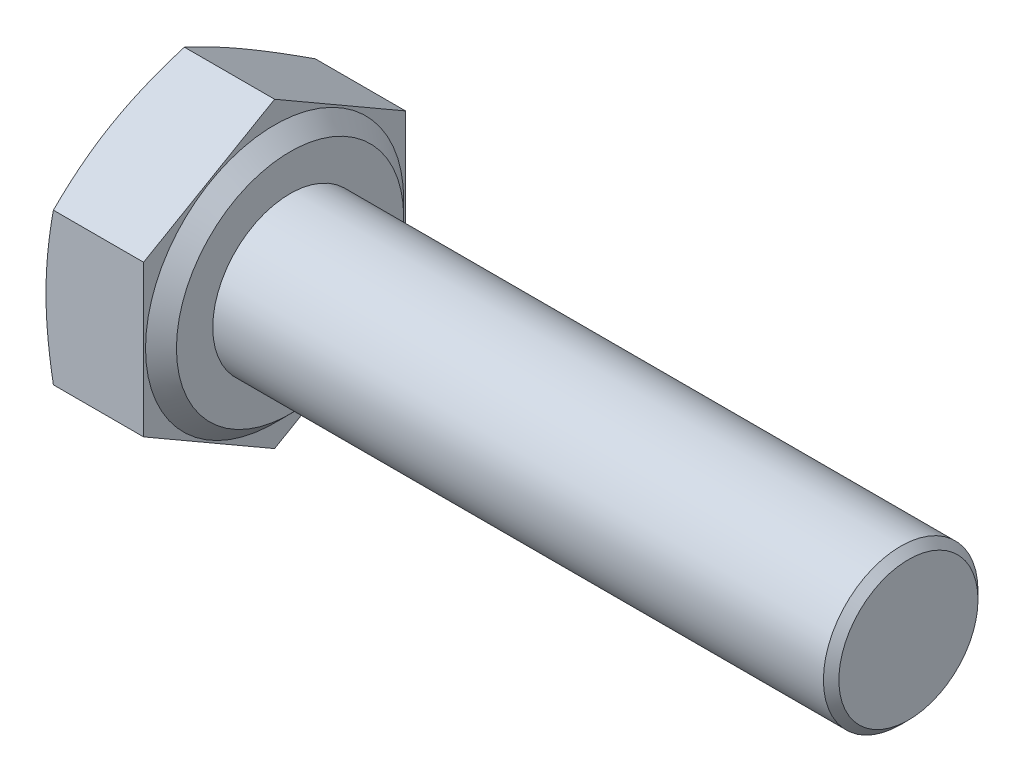
ISO-10303-21;
HEADER;
FILE_DESCRIPTION(('STEP AP214'),'2;1');
FILE_NAME('part.step','',(''),(''),'','','');
FILE_SCHEMA(('AUTOMOTIVE_DESIGN { 1 0 10303 214 1 1 1 1 }'));
ENDSEC;
DATA;
#1=APPLICATION_CONTEXT('core data for automotive mechanical design processes');
#2=APPLICATION_PROTOCOL_DEFINITION('international standard','automotive_design',2000,#1);
#3=PRODUCT_CONTEXT('',#1,'mechanical');
#4=PRODUCT('Part','Part','',(#3));
#5=PRODUCT_RELATED_PRODUCT_CATEGORY('part','',(#4));
#6=PRODUCT_DEFINITION_FORMATION('','',#4);
#7=PRODUCT_DEFINITION_CONTEXT('part definition',#1,'design');
#8=PRODUCT_DEFINITION('design','',#6,#7);
#9=PRODUCT_DEFINITION_SHAPE('','',#8);
#10=(LENGTH_UNIT() NAMED_UNIT(*) SI_UNIT(.MILLI.,.METRE.));
#11=(NAMED_UNIT(*) PLANE_ANGLE_UNIT() SI_UNIT($,.RADIAN.));
#12=(NAMED_UNIT(*) SI_UNIT($,.STERADIAN.) SOLID_ANGLE_UNIT());
#13=UNCERTAINTY_MEASURE_WITH_UNIT(LENGTH_MEASURE(1.E-05),#10,'distance_accuracy_value','');
#14=(GEOMETRIC_REPRESENTATION_CONTEXT(3) GLOBAL_UNCERTAINTY_ASSIGNED_CONTEXT((#13)) GLOBAL_UNIT_ASSIGNED_CONTEXT((#10,
#11,#12)) REPRESENTATION_CONTEXT('',''));
#15=CARTESIAN_POINT('',(0.,0.,0.));
#16=DIRECTION('',(0.,0.,1.));
#17=DIRECTION('',(1.,0.,0.));
#18=AXIS2_PLACEMENT_3D('',#15,#16,#17);
#19=CARTESIAN_POINT('',(2.925,-5.87165223765849,3.39));
#20=DIRECTION('',(-1.,0.,0.));
#21=DIRECTION('',(0.,0.,1.));
#22=AXIS2_PLACEMENT_3D('',#19,#20,#21);
#23=PLANE('',#22);
#24=CARTESIAN_POINT('',(2.925,0.,0.));
#25=DIRECTION('',(-1.,0.,0.));
#26=DIRECTION('',(0.,0.,1.));
#27=AXIS2_PLACEMENT_3D('',#24,#25,#26);
#28=CIRCLE('',#27,2.94);
#29=CARTESIAN_POINT('',(2.925,0.,2.94));
#30=VERTEX_POINT('',#29);
#31=EDGE_CURVE('E381',#30,#30,#28,.T.);
#32=ORIENTED_EDGE('',*,*,#31,.F.);
#33=EDGE_LOOP('',(#32));
#34=FACE_BOUND('',#33,.T.);
#35=CARTESIAN_POINT('',(2.925,0.,0.));
#36=DIRECTION('',(-1.,0.,0.));
#37=DIRECTION('',(0.,0.,1.));
#38=AXIS2_PLACEMENT_3D('',#35,#36,#37);
#39=CIRCLE('',#38,2.);
#40=CARTESIAN_POINT('',(2.925,0.,2.));
#41=VERTEX_POINT('',#40);
#42=EDGE_CURVE('E153',#41,#41,#39,.F.);
#43=ORIENTED_EDGE('',*,*,#42,.F.);
#44=EDGE_LOOP('',(#43));
#45=FACE_BOUND('',#44,.T.);
#46=ADVANCED_FACE('F37',(#34,#45),#23,.F.);
#47=CARTESIAN_POINT('',(2.925,-3.91443482510566,0.));
#48=DIRECTION('',(0.,0.866025403784439,0.5));
#49=DIRECTION('',(0.,-0.5,0.866025403784439));
#50=AXIS2_PLACEMENT_3D('',#47,#48,#49);
#51=PLANE('',#50);
#52=CARTESIAN_POINT('',(0.190920695673182,-1.957101942499,-3.3902));
#53=CARTESIAN_POINT('',(0.161404170530895,-2.03816412054654,-3.24979618904947));
#54=CARTESIAN_POINT('',(0.134553686064012,-2.11949362286094,-3.10892935888662));
#55=CARTESIAN_POINT('',(0.087314294592719,-2.28268148917413,-2.82627968325343));
#56=CARTESIAN_POINT('',(0.0669304448507114,-2.36454021625955,-2.68449620889857));
#57=CARTESIAN_POINT('',(0.0339601092717298,-2.52787800101785,-2.40158686690143));
#58=CARTESIAN_POINT('',(0.0213017035221394,-2.6093533276861,-2.26046746154876));
#59=CARTESIAN_POINT('',(0.00432321252371604,-2.77249453116584,-1.97789860831391));
#60=CARTESIAN_POINT('',(0.,-2.85416032499754,-1.83644930415696));
#61=CARTESIAN_POINT('',(0.,-3.01749191266095,-1.55355069584304));
#62=CARTESIAN_POINT('',(0.00432321252371604,-3.09915770649266,-1.41210139168608));
#63=CARTESIAN_POINT('',(0.0213017035221394,-3.2622989099724,-1.12953253845124));
#64=CARTESIAN_POINT('',(0.0339601092717299,-3.34377423664064,-0.988413133098569));
#65=CARTESIAN_POINT('',(0.0669304448507115,-3.50711202139895,-0.70550379110143));
#66=CARTESIAN_POINT('',(0.087314294592719,-3.58897074848437,-0.563720316746573));
#67=CARTESIAN_POINT('',(0.134553686064013,-3.75215861479756,-0.281070641113374));
#68=CARTESIAN_POINT('',(0.161404170530895,-3.83348811711196,-0.140203810950532));
#69=CARTESIAN_POINT('',(0.190920695673182,-3.9145502951595,0.000200000000001568));
#70=B_SPLINE_CURVE_WITH_KNOTS('',3,(#52,#53,#54,#55,#56,#57,#58,#59,#60,#61,#62,#63,#64,#65,#66,
#67,#68,#69),.UNSPECIFIED.,.F.,.F.,(4,2,2,2,2,2,2,2,4),(0.,0.494419076649432,0.98922386830733,
1.47934907283627,1.96929035184584,2.45923163085541,2.94935683538435,3.44416162704225,
3.93858070369168),.UNSPECIFIED.);
#71=CARTESIAN_POINT('',(0.19087866615106,-1.95721741255283,-3.39));
#72=VERTEX_POINT('',#71);
#73=CARTESIAN_POINT('',(0.,-2.93582611882925,-1.695));
#74=VERTEX_POINT('',#73);
#75=EDGE_CURVE('E116',#72,#74,#70,.T.);
#76=ORIENTED_EDGE('',*,*,#75,.F.);
#77=DIRECTION('',(-1.,0.,0.));
#78=VECTOR('',#77,1.);
#79=CARTESIAN_POINT('',(2.925,-1.95721741255283,-3.39));
#80=LINE('',#79,#78);
#81=CARTESIAN_POINT('',(2.525,-1.95721741255283,-3.39));
#82=VERTEX_POINT('',#81);
#83=EDGE_CURVE('E145',#82,#72,#80,.T.);
#84=ORIENTED_EDGE('',*,*,#83,.F.);
#85=DIRECTION('',(0.,0.5,-0.866025403784439));
#86=VECTOR('',#85,1.);
#87=CARTESIAN_POINT('',(2.525,-3.91443482510566,0.));
#88=LINE('',#87,#86);
#89=CARTESIAN_POINT('',(2.525,-3.91443482510566,0.));
#90=VERTEX_POINT('',#89);
#91=EDGE_CURVE('E396',#90,#82,#88,.T.);
#92=ORIENTED_EDGE('',*,*,#91,.F.);
#93=DIRECTION('',(-1.,0.,0.));
#94=VECTOR('',#93,1.);
#95=CARTESIAN_POINT('',(2.925,-3.91443482510566,0.));
#96=LINE('',#95,#94);
#97=CARTESIAN_POINT('',(0.19087866615106,-3.91443482510566,0.));
#98=VERTEX_POINT('',#97);
#99=EDGE_CURVE('E139',#90,#98,#96,.T.);
#100=ORIENTED_EDGE('',*,*,#99,.T.);
#101=EDGE_CURVE('E219',#74,#98,#70,.T.);
#102=ORIENTED_EDGE('',*,*,#101,.F.);
#103=EDGE_LOOP('',(#76,#84,#92,#100,#102));
#104=FACE_BOUND('',#103,.T.);
#105=ADVANCED_FACE('F169',(#104),#51,.F.);
#106=CARTESIAN_POINT('',(2.925,-1.95721741255283,-3.39));
#107=DIRECTION('',(0.,0.,1.));
#108=DIRECTION('',(0.,-1.,0.));
#109=AXIS2_PLACEMENT_3D('',#106,#107,#108);
#110=PLANE('',#109);
#111=CARTESIAN_POINT('',(1.01997989354759,-5.18202350349092,-3.39));
#112=CARTESIAN_POINT('',(0.973277002242208,-5.02864764339971,-3.39));
#113=CARTESIAN_POINT('',(0.92711907287694,-4.87510275748851,-3.39));
#114=CARTESIAN_POINT('',(0.836194610175299,-4.56758888202956,-3.39));
#115=CARTESIAN_POINT('',(0.791428186940742,-4.41361985996635,-3.39));
#116=CARTESIAN_POINT('',(0.703513740136747,-4.1049081257591,-3.39));
#117=CARTESIAN_POINT('',(0.660368891930327,-3.9501645060724,-3.39));
#118=CARTESIAN_POINT('',(0.576202703755944,-3.64010163790345,-3.39));
#119=CARTESIAN_POINT('',(0.535181325660586,-3.48478239981026,-3.39));
#120=CARTESIAN_POINT('',(0.456277437117914,-3.17538416295869,-3.39));
#121=CARTESIAN_POINT('',(0.41836246095362,-3.02131348495735,-3.39));
#122=CARTESIAN_POINT('',(0.345760478621676,-2.71240531015016,-3.39));
#123=CARTESIAN_POINT('',(0.31107352977889,-2.55756779977793,-3.39));
#124=CARTESIAN_POINT('',(0.245736727919533,-2.24709331546656,-3.39));
#125=CARTESIAN_POINT('',(0.215085449738309,-2.09145664402713,-3.39));
#126=CARTESIAN_POINT('',(0.158752150984607,-1.7792761387277,-3.39));
#127=CARTESIAN_POINT('',(0.133070078323606,-1.62273231439442,-3.39));
#128=CARTESIAN_POINT('',(0.090261553181783,-1.32636320569982,-3.39));
#129=CARTESIAN_POINT('',(0.0724987882413199,-1.18663069691262,-3.39));
#130=CARTESIAN_POINT('',(0.0424324881028125,-0.90658866966141,-3.39));
#131=CARTESIAN_POINT('',(0.0301282534946796,-0.766279227447352,-3.39));
#132=CARTESIAN_POINT('',(0.0115684693108668,-0.485347204994704,-3.39));
#133=CARTESIAN_POINT('',(0.00530893988923471,-0.344724891973988,-3.39));
#134=CARTESIAN_POINT('',(-0.000843430608762965,-0.0633395865578563,-3.39));
#135=CARTESIAN_POINT('',(-0.000736316645790475,0.0774234048370814,-3.39));
#136=CARTESIAN_POINT('',(0.00585535977490626,0.359511810579511,-3.39));
#137=CARTESIAN_POINT('',(0.0123722627973921,0.500836456802893,-3.39));
#138=CARTESIAN_POINT('',(0.0314839573460986,0.783070507641831,-3.39));
#139=CARTESIAN_POINT('',(0.0440788948926872,0.923979902199434,-3.39));
#140=CARTESIAN_POINT('',(0.0747561661274569,1.20531451424879,-3.39));
#141=CARTESIAN_POINT('',(0.0928432130380238,1.34573921068275,-3.39));
#142=CARTESIAN_POINT('',(0.133775937021107,1.62588419860853,-3.39));
#143=CARTESIAN_POINT('',(0.156621639598428,1.76560448632084,-3.39));
#144=CARTESIAN_POINT('',(0.233780310562576,2.19842531997455,-3.39));
#145=CARTESIAN_POINT('',(0.2949559556305,2.49029899907325,-3.39));
#146=CARTESIAN_POINT('',(0.429080881996319,3.07133579793219,-3.39));
#147=CARTESIAN_POINT('',(0.50203440390027,3.36049790156764,-3.39));
#148=CARTESIAN_POINT('',(0.655790287789299,3.93710836070672,-3.39));
#149=CARTESIAN_POINT('',(0.736602683097902,4.22455401473238,-3.39));
#150=CARTESIAN_POINT('',(0.903426263150169,4.79786794795153,-3.39));
#151=CARTESIAN_POINT('',(0.989436623009952,5.08373646960922,-3.39));
#152=CARTESIAN_POINT('',(1.16408508397131,5.65121216000978,-3.39));
#153=CARTESIAN_POINT('',(1.25268370134974,5.93283153633289,-3.39));
#154=CARTESIAN_POINT('',(1.43239756302466,6.49527837196232,-3.39));
#155=CARTESIAN_POINT('',(1.52351292806606,6.77610579255849,-3.39));
#156=CARTESIAN_POINT('',(1.70722886302289,7.3360928788821,-3.39));
#157=CARTESIAN_POINT('',(1.79982248576516,7.61525482955922,-3.39));
#158=CARTESIAN_POINT('',(1.98639802369662,8.17308924398157,-3.39));
#159=CARTESIAN_POINT('',(2.08037982391118,8.45176174614948,-3.39));
#160=CARTESIAN_POINT('',(2.17484728105454,8.73026714408881,-3.39));
#161=B_SPLINE_CURVE_WITH_KNOTS('',3,(#111,#112,#113,#114,#115,#116,#117,#118,#119,#120,#121,
#122,#123,#124,#125,#126,#127,#128,#129,#130,#131,#132,#133,#134,#135,#136,#137,#138,#139,#140,
#141,#142,#143,#144,#145,#146,#147,#148,#149,#150,#151,#152,#153,#154,#155,#156,#157,#158,#159,
#160),.UNSPECIFIED.,.F.,.F.,(4,2,2,2,2,2,2,2,2,2,2,2,2,2,2,2,2,2,2,2,2,2,2,2,4),(0.,
0.480989717785644,0.962017397120821,1.44394255408912,1.92585905497698,2.40183354492129,
2.87781648583752,3.35363088376765,3.82944029381557,4.25191845933479,4.67434247641531,
5.09648817867019,5.51863089977051,5.94291452361967,6.36720834108242,6.79186731337204,
7.21652856175055,8.11074113208825,9.00527638324549,9.90096905563469,10.7965199586567,
11.6821858830082,12.5678943726271,13.4502421784021,14.3325173097535),.UNSPECIFIED.);
#162=CARTESIAN_POINT('',(0.19087866615106,1.95721741255283,-3.39));
#163=VERTEX_POINT('',#162);
#164=CARTESIAN_POINT('',(0.,0.,-3.39));
#165=VERTEX_POINT('',#164);
#166=EDGE_CURVE('E231',#163,#165,#161,.F.);
#167=ORIENTED_EDGE('',*,*,#166,.F.);
#168=DIRECTION('',(-1.,0.,0.));
#169=VECTOR('',#168,1.);
#170=CARTESIAN_POINT('',(2.925,1.95721741255283,-3.39));
#171=LINE('',#170,#169);
#172=CARTESIAN_POINT('',(2.525,1.95721741255283,-3.39));
#173=VERTEX_POINT('',#172);
#174=EDGE_CURVE('E136',#173,#163,#171,.T.);
#175=ORIENTED_EDGE('',*,*,#174,.F.);
#176=DIRECTION('',(0.,1.,0.));
#177=VECTOR('',#176,1.);
#178=CARTESIAN_POINT('',(2.525,-1.95721741255283,-3.39));
#179=LINE('',#178,#177);
#180=EDGE_CURVE('E394',#82,#173,#179,.T.);
#181=ORIENTED_EDGE('',*,*,#180,.F.);
#182=ORIENTED_EDGE('',*,*,#83,.T.);
#183=EDGE_CURVE('E127',#165,#72,#161,.F.);
#184=ORIENTED_EDGE('',*,*,#183,.F.);
#185=EDGE_LOOP('',(#167,#175,#181,#182,#184));
#186=FACE_BOUND('',#185,.T.);
#187=ADVANCED_FACE('F175',(#186),#110,.F.);
#188=CARTESIAN_POINT('',(2.925,1.95721741255283,-3.39));
#189=DIRECTION('',(0.,-0.866025403784439,0.5));
#190=DIRECTION('',(0.,-0.5,-0.866025403784439));
#191=AXIS2_PLACEMENT_3D('',#188,#189,#190);
#192=PLANE('',#191);
#193=CARTESIAN_POINT('',(0.190920695673182,3.9145502951595,0.000199999999999901));
#194=CARTESIAN_POINT('',(0.161404170530895,3.83348811711196,-0.140203810950534));
#195=CARTESIAN_POINT('',(0.134553686064013,3.75215861479756,-0.281070641113376));
#196=CARTESIAN_POINT('',(0.087314294592719,3.58897074848437,-0.563720316746575));
#197=CARTESIAN_POINT('',(0.0669304448507114,3.50711202139895,-0.705503791101431));
#198=CARTESIAN_POINT('',(0.0339601092717298,3.34377423664064,-0.98841313309857));
#199=CARTESIAN_POINT('',(0.0213017035221394,3.2622989099724,-1.12953253845124));
#200=CARTESIAN_POINT('',(0.00432321252371606,3.09915770649266,-1.41210139168609));
#201=CARTESIAN_POINT('',(0.,3.01749191266095,-1.55355069584304));
#202=CARTESIAN_POINT('',(0.,2.85416032499754,-1.83644930415696));
#203=CARTESIAN_POINT('',(0.004323212523716,2.77249453116584,-1.97789860831392));
#204=CARTESIAN_POINT('',(0.0213017035221393,2.6093533276861,-2.26046746154876));
#205=CARTESIAN_POINT('',(0.0339601092717298,2.52787800101785,-2.40158686690143));
#206=CARTESIAN_POINT('',(0.0669304448507115,2.36454021625954,-2.68449620889857));
#207=CARTESIAN_POINT('',(0.0873142945927191,2.28268148917413,-2.82627968325343));
#208=CARTESIAN_POINT('',(0.134553686064013,2.11949362286094,-3.10892935888663));
#209=CARTESIAN_POINT('',(0.161404170530895,2.03816412054653,-3.24979618904947));
#210=CARTESIAN_POINT('',(0.190920695673182,1.95710194249899,-3.3902));
#211=B_SPLINE_CURVE_WITH_KNOTS('',3,(#193,#194,#195,#196,#197,#198,#199,#200,#201,#202,#203,
#204,#205,#206,#207,#208,#209,#210),.UNSPECIFIED.,.F.,.F.,(4,2,2,2,2,2,2,2,4),(0.,
0.494419076649432,0.98922386830733,1.47934907283627,1.96929035184584,2.45923163085541,
2.94935683538435,3.44416162704224,3.93858070369168),.UNSPECIFIED.);
#212=CARTESIAN_POINT('',(0.19087866615106,3.91443482510566,0.));
#213=VERTEX_POINT('',#212);
#214=CARTESIAN_POINT('',(0.,2.93582611882925,-1.695));
#215=VERTEX_POINT('',#214);
#216=EDGE_CURVE('E389',#213,#215,#211,.T.);
#217=ORIENTED_EDGE('',*,*,#216,.F.);
#218=DIRECTION('',(-1.,0.,0.));
#219=VECTOR('',#218,1.);
#220=CARTESIAN_POINT('',(2.925,3.91443482510566,0.));
#221=LINE('',#220,#219);
#222=CARTESIAN_POINT('',(2.525,3.91443482510566,0.));
#223=VERTEX_POINT('',#222);
#224=EDGE_CURVE('E133',#223,#213,#221,.T.);
#225=ORIENTED_EDGE('',*,*,#224,.F.);
#226=DIRECTION('',(0.,0.5,0.866025403784439));
#227=VECTOR('',#226,1.);
#228=CARTESIAN_POINT('',(2.525,1.95721741255283,-3.39));
#229=LINE('',#228,#227);
#230=EDGE_CURVE('E392',#173,#223,#229,.T.);
#231=ORIENTED_EDGE('',*,*,#230,.F.);
#232=ORIENTED_EDGE('',*,*,#174,.T.);
#233=EDGE_CURVE('E232',#215,#163,#211,.T.);
#234=ORIENTED_EDGE('',*,*,#233,.F.);
#235=EDGE_LOOP('',(#217,#225,#231,#232,#234));
#236=FACE_BOUND('',#235,.T.);
#237=ADVANCED_FACE('F240',(#236),#192,.F.);
#238=CARTESIAN_POINT('',(2.925,3.91443482510566,0.));
#239=DIRECTION('',(0.,-0.866025403784439,-0.5));
#240=DIRECTION('',(0.,0.5,-0.866025403784439));
#241=AXIS2_PLACEMENT_3D('',#238,#239,#240);
#242=PLANE('',#241);
#243=CARTESIAN_POINT('',(0.190920695673182,1.957101942499,3.3902));
#244=CARTESIAN_POINT('',(0.161404170530895,2.03816412054654,3.24979618904947));
#245=CARTESIAN_POINT('',(0.134553686064013,2.11949362286094,3.10892935888663));
#246=CARTESIAN_POINT('',(0.0873142945927194,2.28268148917413,2.82627968325343));
#247=CARTESIAN_POINT('',(0.0669304448507119,2.36454021625955,2.68449620889857));
#248=CARTESIAN_POINT('',(0.0339601092717302,2.52787800101785,2.40158686690143));
#249=CARTESIAN_POINT('',(0.0213017035221396,2.6093533276861,2.26046746154876));
#250=CARTESIAN_POINT('',(0.00432321252371627,2.77249453116584,1.97789860831392));
#251=CARTESIAN_POINT('',(0.,2.85416032499754,1.83644930415696));
#252=CARTESIAN_POINT('',(0.,3.01749191266095,1.55355069584304));
#253=CARTESIAN_POINT('',(0.00432321252371614,3.09915770649266,1.41210139168609));
#254=CARTESIAN_POINT('',(0.0213017035221394,3.2622989099724,1.12953253845124));
#255=CARTESIAN_POINT('',(0.0339601092717299,3.34377423664064,0.98841313309857));
#256=CARTESIAN_POINT('',(0.0669304448507115,3.50711202139895,0.705503791101431));
#257=CARTESIAN_POINT('',(0.0873142945927191,3.58897074848437,0.563720316746575));
#258=CARTESIAN_POINT('',(0.134553686064013,3.75215861479756,0.281070641113376));
#259=CARTESIAN_POINT('',(0.161404170530895,3.83348811711196,0.140203810950534));
#260=CARTESIAN_POINT('',(0.190920695673182,3.9145502951595,-0.000200000000000473));
#261=B_SPLINE_CURVE_WITH_KNOTS('',3,(#243,#244,#245,#246,#247,#248,#249,#250,#251,#252,#253,
#254,#255,#256,#257,#258,#259,#260),.UNSPECIFIED.,.F.,.F.,(4,2,2,2,2,2,2,2,4),(0.,
0.494419076649432,0.98922386830733,1.47934907283627,1.96929035184584,2.45923163085541,
2.94935683538435,3.44416162704225,3.93858070369168),.UNSPECIFIED.);
#262=CARTESIAN_POINT('',(0.19087866615106,1.95721741255283,3.39));
#263=VERTEX_POINT('',#262);
#264=CARTESIAN_POINT('',(0.,2.93582611882925,1.695));
#265=VERTEX_POINT('',#264);
#266=EDGE_CURVE('E111',#263,#265,#261,.T.);
#267=ORIENTED_EDGE('',*,*,#266,.F.);
#268=DIRECTION('',(-1.,0.,0.));
#269=VECTOR('',#268,1.);
#270=CARTESIAN_POINT('',(2.925,1.95721741255283,3.39));
#271=LINE('',#270,#269);
#272=CARTESIAN_POINT('',(2.525,1.95721741255283,3.39));
#273=VERTEX_POINT('',#272);
#274=EDGE_CURVE('E124',#273,#263,#271,.T.);
#275=ORIENTED_EDGE('',*,*,#274,.F.);
#276=DIRECTION('',(0.,-0.5,0.866025403784439));
#277=VECTOR('',#276,1.);
#278=CARTESIAN_POINT('',(2.525,3.91443482510566,0.));
#279=LINE('',#278,#277);
#280=EDGE_CURVE('E386',#223,#273,#279,.T.);
#281=ORIENTED_EDGE('',*,*,#280,.F.);
#282=ORIENTED_EDGE('',*,*,#224,.T.);
#283=EDGE_CURVE('E126',#265,#213,#261,.T.);
#284=ORIENTED_EDGE('',*,*,#283,.F.);
#285=EDGE_LOOP('',(#267,#275,#281,#282,#284));
#286=FACE_BOUND('',#285,.T.);
#287=ADVANCED_FACE('F122',(#286),#242,.F.);
#288=CARTESIAN_POINT('',(2.925,1.95721741255283,3.39));
#289=DIRECTION('',(0.,0.,-1.));
#290=DIRECTION('',(0.,1.,0.));
#291=AXIS2_PLACEMENT_3D('',#288,#289,#290);
#292=PLANE('',#291);
#293=CARTESIAN_POINT('',(1.01997989354759,-5.18202350349092,3.39));
#294=CARTESIAN_POINT('',(0.973277002242208,-5.02864764339971,3.39));
#295=CARTESIAN_POINT('',(0.92711907287694,-4.87510275748851,3.39));
#296=CARTESIAN_POINT('',(0.836194610175299,-4.56758888202956,3.39));
#297=CARTESIAN_POINT('',(0.791428186940742,-4.41361985996635,3.39));
#298=CARTESIAN_POINT('',(0.703513740136747,-4.1049081257591,3.39));
#299=CARTESIAN_POINT('',(0.660368891930328,-3.9501645060724,3.39));
#300=CARTESIAN_POINT('',(0.576202703755944,-3.64010163790345,3.39));
#301=CARTESIAN_POINT('',(0.535181325660586,-3.48478239981026,3.39));
#302=CARTESIAN_POINT('',(0.456277437117914,-3.17538416295869,3.39));
#303=CARTESIAN_POINT('',(0.418362460953621,-3.02131348495735,3.39));
#304=CARTESIAN_POINT('',(0.345760478621677,-2.71240531015016,3.39));
#305=CARTESIAN_POINT('',(0.311073529778891,-2.55756779977793,3.39));
#306=CARTESIAN_POINT('',(0.245736727919534,-2.24709331546655,3.39));
#307=CARTESIAN_POINT('',(0.21508544973831,-2.09145664402713,3.39));
#308=CARTESIAN_POINT('',(0.158752150984608,-1.7792761387277,3.39));
#309=CARTESIAN_POINT('',(0.133070078323607,-1.62273231439442,3.39));
#310=CARTESIAN_POINT('',(0.0902615531817833,-1.32636320569982,3.39));
#311=CARTESIAN_POINT('',(0.0724987882413202,-1.18663069691261,3.39));
#312=CARTESIAN_POINT('',(0.0424324881028128,-0.906588669661408,3.39));
#313=CARTESIAN_POINT('',(0.0301282534946798,-0.76627922744735,3.39));
#314=CARTESIAN_POINT('',(0.0115684693108671,-0.485347204994702,3.39));
#315=CARTESIAN_POINT('',(0.00530893988923525,-0.344724891973987,3.39));
#316=CARTESIAN_POINT('',(-0.000843430608762385,-0.0633395865578552,3.39));
#317=CARTESIAN_POINT('',(-0.000736316645790061,0.0774234048370824,3.39));
#318=CARTESIAN_POINT('',(0.00585535977490662,0.359511810579512,3.39));
#319=CARTESIAN_POINT('',(0.0123722627973926,0.500836456802894,3.39));
#320=CARTESIAN_POINT('',(0.0314839573460992,0.783070507641832,3.39));
#321=CARTESIAN_POINT('',(0.0440788948926877,0.923979902199436,3.39));
#322=CARTESIAN_POINT('',(0.0747561661274574,1.2053145142488,3.39));
#323=CARTESIAN_POINT('',(0.0928432130380244,1.34573921068275,3.39));
#324=CARTESIAN_POINT('',(0.133775937021107,1.62588419860853,3.39));
#325=CARTESIAN_POINT('',(0.156621639598429,1.76560448632085,3.39));
#326=CARTESIAN_POINT('',(0.233780310562576,2.19842531997455,3.39));
#327=CARTESIAN_POINT('',(0.294955955630501,2.49029899907325,3.39));
#328=CARTESIAN_POINT('',(0.42908088199632,3.07133579793219,3.39));
#329=CARTESIAN_POINT('',(0.50203440390027,3.36049790156764,3.39));
#330=CARTESIAN_POINT('',(0.655790287789299,3.93710836070672,3.39));
#331=CARTESIAN_POINT('',(0.736602683097902,4.22455401473238,3.39));
#332=CARTESIAN_POINT('',(0.903426263150169,4.79786794795153,3.39));
#333=CARTESIAN_POINT('',(0.989436623009952,5.08373646960922,3.39));
#334=CARTESIAN_POINT('',(1.16408508397131,5.65121216000978,3.39));
#335=CARTESIAN_POINT('',(1.25268370134974,5.93283153633289,3.39));
#336=CARTESIAN_POINT('',(1.43239756302466,6.49527837196232,3.39));
#337=CARTESIAN_POINT('',(1.52351292806606,6.77610579255849,3.39));
#338=CARTESIAN_POINT('',(1.70722886302289,7.3360928788821,3.39));
#339=CARTESIAN_POINT('',(1.79982248576516,7.61525482955923,3.39));
#340=CARTESIAN_POINT('',(1.98639802369662,8.17308924398157,3.39));
#341=CARTESIAN_POINT('',(2.08037982391118,8.45176174614948,3.39));
#342=CARTESIAN_POINT('',(2.17484728105455,8.73026714408881,3.39));
#343=B_SPLINE_CURVE_WITH_KNOTS('',3,(#293,#294,#295,#296,#297,#298,#299,#300,#301,#302,#303,
#304,#305,#306,#307,#308,#309,#310,#311,#312,#313,#314,#315,#316,#317,#318,#319,#320,#321,#322,
#323,#324,#325,#326,#327,#328,#329,#330,#331,#332,#333,#334,#335,#336,#337,#338,#339,#340,#341,
#342),.UNSPECIFIED.,.F.,.F.,(4,2,2,2,2,2,2,2,2,2,2,2,2,2,2,2,2,2,2,2,2,2,2,2,4),(0.,
0.480989717785644,0.96201739712082,1.44394255408912,1.92585905497698,2.40183354492129,
2.87781648583752,3.35363088376765,3.82944029381557,4.25191845933479,4.67434247641531,
5.09648817867019,5.51863089977051,5.94291452361967,6.36720834108242,6.79186731337204,
7.21652856175055,8.11074113208825,9.00527638324549,9.90096905563469,10.7965199586567,
11.6821858830083,12.5678943726271,13.4502421784021,14.3325173097535),.UNSPECIFIED.);
#344=CARTESIAN_POINT('',(0.19087866615106,-1.95721741255283,3.39));
#345=VERTEX_POINT('',#344);
#346=CARTESIAN_POINT('',(0.,0.,3.39));
#347=VERTEX_POINT('',#346);
#348=EDGE_CURVE('E118',#345,#347,#343,.T.);
#349=ORIENTED_EDGE('',*,*,#348,.F.);
#350=DIRECTION('',(-1.,0.,0.));
#351=VECTOR('',#350,1.);
#352=CARTESIAN_POINT('',(2.925,-1.95721741255283,3.39));
#353=LINE('',#352,#351);
#354=CARTESIAN_POINT('',(2.525,-1.95721741255283,3.39));
#355=VERTEX_POINT('',#354);
#356=EDGE_CURVE('E134',#355,#345,#353,.T.);
#357=ORIENTED_EDGE('',*,*,#356,.F.);
#358=DIRECTION('',(0.,-1.,0.));
#359=VECTOR('',#358,1.);
#360=CARTESIAN_POINT('',(2.525,1.95721741255283,3.39));
#361=LINE('',#360,#359);
#362=EDGE_CURVE('E132',#273,#355,#361,.T.);
#363=ORIENTED_EDGE('',*,*,#362,.F.);
#364=ORIENTED_EDGE('',*,*,#274,.T.);
#365=EDGE_CURVE('E108',#347,#263,#343,.T.);
#366=ORIENTED_EDGE('',*,*,#365,.F.);
#367=EDGE_LOOP('',(#349,#357,#363,#364,#366));
#368=FACE_BOUND('',#367,.T.);
#369=ADVANCED_FACE('F130',(#368),#292,.F.);
#370=CARTESIAN_POINT('',(2.925,-1.95721741255283,3.39));
#371=DIRECTION('',(0.,0.866025403784439,-0.5));
#372=DIRECTION('',(0.,0.5,0.866025403784439));
#373=AXIS2_PLACEMENT_3D('',#370,#371,#372);
#374=PLANE('',#373);
#375=CARTESIAN_POINT('',(0.190920695673182,-3.9145502951595,-0.000199999999998797));
#376=CARTESIAN_POINT('',(0.161404170530895,-3.83348811711196,0.140203810950535));
#377=CARTESIAN_POINT('',(0.134553686064013,-3.75215861479756,0.281070641113377));
#378=CARTESIAN_POINT('',(0.0873142945927192,-3.58897074848437,0.563720316746576));
#379=CARTESIAN_POINT('',(0.0669304448507115,-3.50711202139895,0.705503791101432));
#380=CARTESIAN_POINT('',(0.0339601092717298,-3.34377423664064,0.988413133098571));
#381=CARTESIAN_POINT('',(0.0213017035221393,-3.2622989099724,1.12953253845124));
#382=CARTESIAN_POINT('',(0.004323212523716,-3.09915770649266,1.41210139168609));
#383=CARTESIAN_POINT('',(0.,-3.01749191266095,1.55355069584304));
#384=CARTESIAN_POINT('',(0.,-2.85416032499754,1.83644930415696));
#385=CARTESIAN_POINT('',(0.00432321252371614,-2.77249453116584,1.97789860831392));
#386=CARTESIAN_POINT('',(0.0213017035221394,-2.6093533276861,2.26046746154876));
#387=CARTESIAN_POINT('',(0.0339601092717299,-2.52787800101785,2.40158686690143));
#388=CARTESIAN_POINT('',(0.0669304448507115,-2.36454021625954,2.68449620889857));
#389=CARTESIAN_POINT('',(0.0873142945927191,-2.28268148917413,2.82627968325343));
#390=CARTESIAN_POINT('',(0.134553686064013,-2.11949362286094,3.10892935888663));
#391=CARTESIAN_POINT('',(0.161404170530895,-2.03816412054653,3.24979618904947));
#392=CARTESIAN_POINT('',(0.190920695673182,-1.95710194249899,3.3902));
#393=B_SPLINE_CURVE_WITH_KNOTS('',3,(#375,#376,#377,#378,#379,#380,#381,#382,#383,#384,#385,
#386,#387,#388,#389,#390,#391,#392),.UNSPECIFIED.,.F.,.F.,(4,2,2,2,2,2,2,2,4),(0.,
0.494419076649432,0.989223868307329,1.47934907283627,1.96929035184584,2.45923163085541,
2.94935683538435,3.44416162704224,3.93858070369168),.UNSPECIFIED.);
#394=CARTESIAN_POINT('',(0.,-2.93582611882925,1.695));
#395=VERTEX_POINT('',#394);
#396=EDGE_CURVE('E201',#98,#395,#393,.T.);
#397=ORIENTED_EDGE('',*,*,#396,.F.);
#398=ORIENTED_EDGE('',*,*,#99,.F.);
#399=DIRECTION('',(0.,-0.5,-0.866025403784439));
#400=VECTOR('',#399,1.);
#401=CARTESIAN_POINT('',(2.525,-1.95721741255283,3.39));
#402=LINE('',#401,#400);
#403=EDGE_CURVE('E148',#355,#90,#402,.T.);
#404=ORIENTED_EDGE('',*,*,#403,.F.);
#405=ORIENTED_EDGE('',*,*,#356,.T.);
#406=EDGE_CURVE('E195',#395,#345,#393,.T.);
#407=ORIENTED_EDGE('',*,*,#406,.F.);
#408=EDGE_LOOP('',(#397,#398,#404,#405,#407));
#409=FACE_BOUND('',#408,.T.);
#410=ADVANCED_FACE('F186',(#409),#374,.F.);
#411=CARTESIAN_POINT('',(2.525,3.34,0.));
#412=DIRECTION('',(1.,0.,0.));
#413=DIRECTION('',(0.,0.,-1.));
#414=AXIS2_PLACEMENT_3D('',#411,#412,#413);
#415=PLANE('',#414);
#416=CARTESIAN_POINT('',(2.525,0.,0.));
#417=DIRECTION('',(-1.,0.,0.));
#418=DIRECTION('',(0.,0.,1.));
#419=AXIS2_PLACEMENT_3D('',#416,#417,#418);
#420=CIRCLE('',#419,3.34);
#421=CARTESIAN_POINT('',(2.525,0.,3.34));
#422=VERTEX_POINT('',#421);
#423=EDGE_CURVE('E384',#422,#422,#420,.T.);
#424=ORIENTED_EDGE('',*,*,#423,.T.);
#425=EDGE_LOOP('',(#424));
#426=FACE_BOUND('',#425,.T.);
#427=ORIENTED_EDGE('',*,*,#91,.T.);
#428=ORIENTED_EDGE('',*,*,#180,.T.);
#429=ORIENTED_EDGE('',*,*,#230,.T.);
#430=ORIENTED_EDGE('',*,*,#280,.T.);
#431=ORIENTED_EDGE('',*,*,#362,.T.);
#432=ORIENTED_EDGE('',*,*,#403,.T.);
#433=EDGE_LOOP('',(#427,#428,#429,#430,#431,#432));
#434=FACE_BOUND('',#433,.T.);
#435=ADVANCED_FACE('F190',(#426,#434),#415,.T.);
#436=CARTESIAN_POINT('',(2.525,0.,0.));
#437=DIRECTION('',(-1.,0.,0.));
#438=DIRECTION('',(0.,0.,1.));
#439=AXIS2_PLACEMENT_3D('',#436,#437,#438);
#440=CONICAL_SURFACE('',#439,3.34,0.785398163397454);
#441=ORIENTED_EDGE('',*,*,#31,.T.);
#442=EDGE_LOOP('',(#441));
#443=FACE_BOUND('',#442,.T.);
#444=ORIENTED_EDGE('',*,*,#423,.F.);
#445=EDGE_LOOP('',(#444));
#446=FACE_BOUND('',#445,.T.);
#447=ADVANCED_FACE('F181',(#443,#446),#440,.T.);
#448=CARTESIAN_POINT('',(0.,0.,0.));
#449=DIRECTION('',(1.,0.,0.));
#450=DIRECTION('',(0.,0.,-1.));
#451=AXIS2_PLACEMENT_3D('',#448,#449,#450);
#452=CONICAL_SURFACE('',#451,3.39,1.22173047639604);
#453=ORIENTED_EDGE('',*,*,#348,.T.);
#454=CARTESIAN_POINT('',(0.,0.,0.));
#455=DIRECTION('',(-1.,0.,0.));
#456=DIRECTION('',(0.,0.,1.));
#457=AXIS2_PLACEMENT_3D('',#454,#455,#456);
#458=CIRCLE('',#457,3.39);
#459=EDGE_CURVE('E150',#395,#347,#458,.T.);
#460=ORIENTED_EDGE('',*,*,#459,.F.);
#461=ORIENTED_EDGE('',*,*,#406,.T.);
#462=EDGE_LOOP('',(#453,#460,#461));
#463=FACE_BOUND('',#462,.T.);
#464=ADVANCED_FACE('F212',(#463),#452,.T.);
#465=ORIENTED_EDGE('',*,*,#101,.T.);
#466=ORIENTED_EDGE('',*,*,#396,.T.);
#467=EDGE_CURVE('E60',#74,#395,#458,.T.);
#468=ORIENTED_EDGE('',*,*,#467,.F.);
#469=EDGE_LOOP('',(#465,#466,#468));
#470=FACE_BOUND('',#469,.T.);
#471=ADVANCED_FACE('F276',(#470),#452,.T.);
#472=ORIENTED_EDGE('',*,*,#183,.T.);
#473=ORIENTED_EDGE('',*,*,#75,.T.);
#474=EDGE_CURVE('E408',#165,#74,#458,.T.);
#475=ORIENTED_EDGE('',*,*,#474,.F.);
#476=EDGE_LOOP('',(#472,#473,#475));
#477=FACE_BOUND('',#476,.T.);
#478=ADVANCED_FACE('F283',(#477),#452,.T.);
#479=ORIENTED_EDGE('',*,*,#233,.T.);
#480=ORIENTED_EDGE('',*,*,#166,.T.);
#481=EDGE_CURVE('E413',#215,#165,#458,.T.);
#482=ORIENTED_EDGE('',*,*,#481,.F.);
#483=EDGE_LOOP('',(#479,#480,#482));
#484=FACE_BOUND('',#483,.T.);
#485=ADVANCED_FACE('F210',(#484),#452,.T.);
#486=ORIENTED_EDGE('',*,*,#216,.T.);
#487=EDGE_CURVE('E152',#265,#215,#458,.T.);
#488=ORIENTED_EDGE('',*,*,#487,.F.);
#489=ORIENTED_EDGE('',*,*,#283,.T.);
#490=EDGE_LOOP('',(#486,#488,#489));
#491=FACE_BOUND('',#490,.T.);
#492=ADVANCED_FACE('F206',(#491),#452,.T.);
#493=ORIENTED_EDGE('',*,*,#266,.T.);
#494=CARTESIAN_POINT('',(0.,0.,0.));
#495=DIRECTION('',(-1.,0.,0.));
#496=DIRECTION('',(0.,0.,1.));
#497=AXIS2_PLACEMENT_3D('',#494,#495,#496);
#498=CIRCLE('',#497,3.39);
#499=EDGE_CURVE('E52',#347,#265,#498,.T.);
#500=ORIENTED_EDGE('',*,*,#499,.F.);
#501=ORIENTED_EDGE('',*,*,#365,.T.);
#502=EDGE_LOOP('',(#493,#500,#501));
#503=FACE_BOUND('',#502,.T.);
#504=ADVANCED_FACE('F110',(#503),#452,.T.);
#505=CARTESIAN_POINT('',(0.,-5.87165223765849,3.39));
#506=DIRECTION('',(-1.,0.,0.));
#507=DIRECTION('',(0.,0.,1.));
#508=AXIS2_PLACEMENT_3D('',#505,#506,#507);
#509=PLANE('',#508);
#510=ORIENTED_EDGE('',*,*,#459,.T.);
#511=ORIENTED_EDGE('',*,*,#499,.T.);
#512=ORIENTED_EDGE('',*,*,#487,.T.);
#513=ORIENTED_EDGE('',*,*,#481,.T.);
#514=ORIENTED_EDGE('',*,*,#474,.T.);
#515=ORIENTED_EDGE('',*,*,#467,.T.);
#516=EDGE_LOOP('',(#510,#511,#512,#513,#514,#515));
#517=FACE_BOUND('',#516,.T.);
#518=ADVANCED_FACE('F183',(#517),#509,.T.);
#519=CARTESIAN_POINT('',(18.925,0.,0.));
#520=DIRECTION('',(-1.,0.,0.));
#521=DIRECTION('',(0.,0.,1.));
#522=AXIS2_PLACEMENT_3D('',#519,#520,#521);
#523=CYLINDRICAL_SURFACE('',#522,2.);
#524=CARTESIAN_POINT('',(18.725,0.,0.));
#525=DIRECTION('',(1.,0.,0.));
#526=DIRECTION('',(0.,0.,-1.));
#527=AXIS2_PLACEMENT_3D('',#524,#525,#526);
#528=CIRCLE('',#527,2.);
#529=CARTESIAN_POINT('',(18.725,0.,-2.));
#530=VERTEX_POINT('',#529);
#531=EDGE_CURVE('E11',#530,#530,#528,.F.);
#532=ORIENTED_EDGE('',*,*,#531,.T.);
#533=EDGE_LOOP('',(#532));
#534=FACE_BOUND('',#533,.T.);
#535=ORIENTED_EDGE('',*,*,#42,.T.);
#536=EDGE_LOOP('',(#535));
#537=FACE_BOUND('',#536,.T.);
#538=ADVANCED_FACE('F165',(#534,#537),#523,.T.);
#539=CARTESIAN_POINT('',(18.925,0.,0.));
#540=DIRECTION('',(1.,0.,0.));
#541=DIRECTION('',(0.,0.,-1.));
#542=AXIS2_PLACEMENT_3D('',#539,#540,#541);
#543=PLANE('',#542);
#544=CARTESIAN_POINT('',(18.925,0.,0.));
#545=DIRECTION('',(1.,0.,0.));
#546=DIRECTION('',(0.,0.,-1.));
#547=AXIS2_PLACEMENT_3D('',#544,#545,#546);
#548=CIRCLE('',#547,1.8);
#549=CARTESIAN_POINT('',(18.925,0.,-1.8));
#550=VERTEX_POINT('',#549);
#551=EDGE_CURVE('E45',#550,#550,#548,.T.);
#552=ORIENTED_EDGE('',*,*,#551,.T.);
#553=EDGE_LOOP('',(#552));
#554=FACE_BOUND('',#553,.T.);
#555=ADVANCED_FACE('F158',(#554),#543,.T.);
#556=CARTESIAN_POINT('',(18.925,0.,0.));
#557=DIRECTION('',(-1.,0.,0.));
#558=DIRECTION('',(0.,0.,1.));
#559=AXIS2_PLACEMENT_3D('',#556,#557,#558);
#560=CONICAL_SURFACE('',#559,1.8,0.78539816339744);
#561=ORIENTED_EDGE('',*,*,#531,.F.);
#562=EDGE_LOOP('',(#561));
#563=FACE_BOUND('',#562,.T.);
#564=ORIENTED_EDGE('',*,*,#551,.F.);
#565=EDGE_LOOP('',(#564));
#566=FACE_BOUND('',#565,.T.);
#567=ADVANCED_FACE('F39',(#563,#566),#560,.T.);
#568=CLOSED_SHELL('',(#46,#105,#187,#237,#287,#369,#410,#435,#447,#464,#471,#478,#485,#492,#504,
#518,#538,#555,#567));
#569=MANIFOLD_SOLID_BREP('B2',#568);
#570=ADVANCED_BREP_SHAPE_REPRESENTATION('',(#18,#569),#14);
#571=SHAPE_DEFINITION_REPRESENTATION(#9,#570);
ENDSEC;
END-ISO-10303-21;
